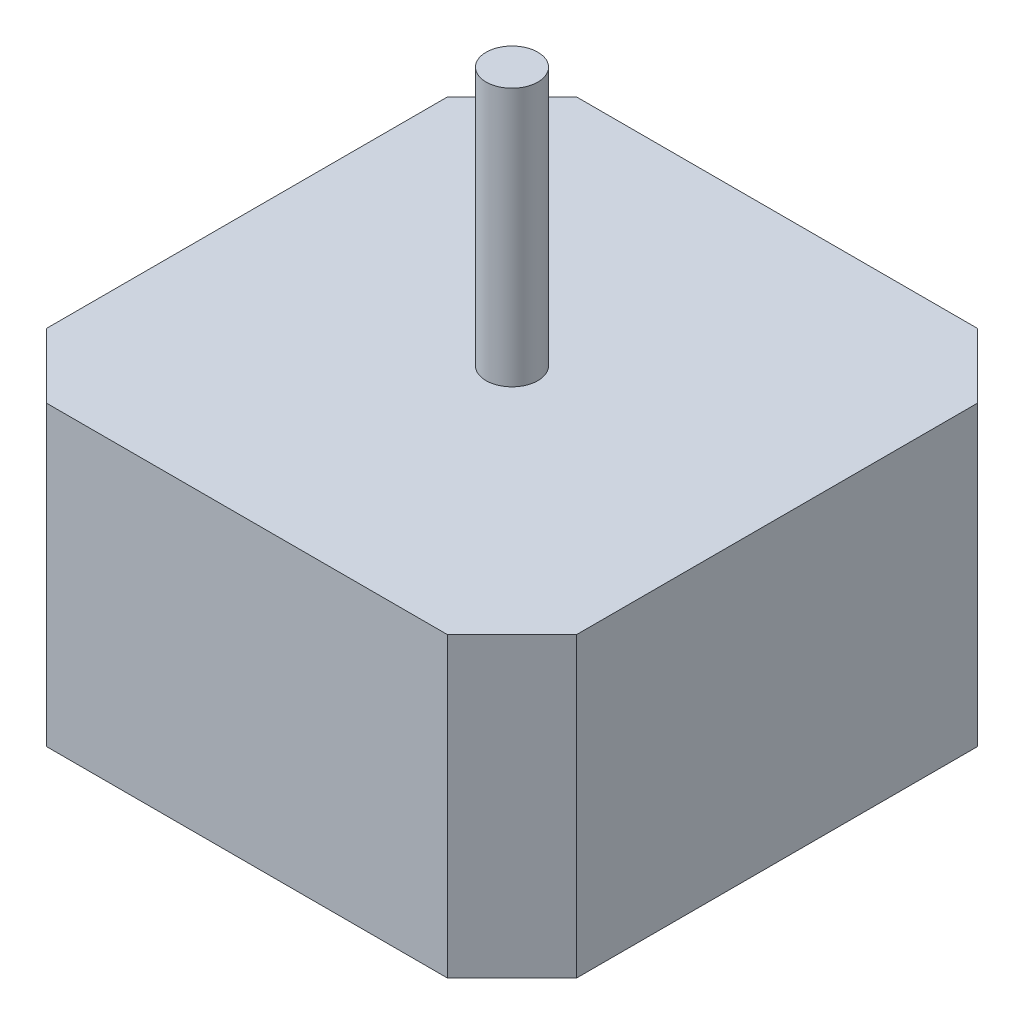
ISO-10303-21;
HEADER;
FILE_DESCRIPTION(('STEP AP214'),'2;1');
FILE_NAME('part.step','',(''),(''),'','','');
FILE_SCHEMA(('AUTOMOTIVE_DESIGN { 1 0 10303 214 1 1 1 1 }'));
ENDSEC;
DATA;
#1=APPLICATION_CONTEXT('core data for automotive mechanical design processes');
#2=APPLICATION_PROTOCOL_DEFINITION('international standard','automotive_design',2000,#1);
#3=PRODUCT_CONTEXT('',#1,'mechanical');
#4=PRODUCT('Part','Part','',(#3));
#5=PRODUCT_RELATED_PRODUCT_CATEGORY('part','',(#4));
#6=PRODUCT_DEFINITION_FORMATION('','',#4);
#7=PRODUCT_DEFINITION_CONTEXT('part definition',#1,'design');
#8=PRODUCT_DEFINITION('design','',#6,#7);
#9=PRODUCT_DEFINITION_SHAPE('','',#8);
#10=(LENGTH_UNIT() NAMED_UNIT(*) SI_UNIT(.MILLI.,.METRE.));
#11=(NAMED_UNIT(*) PLANE_ANGLE_UNIT() SI_UNIT($,.RADIAN.));
#12=(NAMED_UNIT(*) SI_UNIT($,.STERADIAN.) SOLID_ANGLE_UNIT());
#13=UNCERTAINTY_MEASURE_WITH_UNIT(LENGTH_MEASURE(1.E-05),#10,'distance_accuracy_value','');
#14=(GEOMETRIC_REPRESENTATION_CONTEXT(3) GLOBAL_UNCERTAINTY_ASSIGNED_CONTEXT((#13)) GLOBAL_UNIT_ASSIGNED_CONTEXT((#10,
#11,#12)) REPRESENTATION_CONTEXT('',''));
#15=CARTESIAN_POINT('',(0.,0.,0.));
#16=DIRECTION('',(0.,0.,1.));
#17=DIRECTION('',(1.,0.,0.));
#18=AXIS2_PLACEMENT_3D('',#15,#16,#17);
#19=CARTESIAN_POINT('',(7.50925109046818,23.,0.));
#20=DIRECTION('',(-1.,0.,0.));
#21=DIRECTION('',(0.,0.,1.));
#22=AXIS2_PLACEMENT_3D('',#19,#20,#21);
#23=PLANE('',#22);
#24=DIRECTION('',(0.,0.,-1.));
#25=VECTOR('',#24,1.);
#26=CARTESIAN_POINT('',(7.50925109046818,9.,-20.5));
#27=LINE('',#26,#25);
#28=CARTESIAN_POINT('',(7.50925109046818,9.,-20.5));
#29=VERTEX_POINT('',#28);
#30=CARTESIAN_POINT('',(7.50925109046818,9.,-24.5027591201534));
#31=VERTEX_POINT('',#30);
#32=EDGE_CURVE('E139',#29,#31,#27,.T.);
#33=ORIENTED_EDGE('',*,*,#32,.F.);
#34=DIRECTION('',(0.,-1.,0.));
#35=VECTOR('',#34,1.);
#36=CARTESIAN_POINT('',(7.50925109046818,23.,-20.5));
#37=LINE('',#36,#35);
#38=CARTESIAN_POINT('',(7.50925109046818,0.,-20.5));
#39=VERTEX_POINT('',#38);
#40=EDGE_CURVE('E11',#29,#39,#37,.T.);
#41=ORIENTED_EDGE('',*,*,#40,.T.);
#42=DIRECTION('',(0.,0.,-1.));
#43=VECTOR('',#42,1.);
#44=CARTESIAN_POINT('',(7.50925109046818,0.,0.));
#45=LINE('',#44,#43);
#46=CARTESIAN_POINT('',(7.50925109046818,0.,-24.5027591201534));
#47=VERTEX_POINT('',#46);
#48=EDGE_CURVE('E169',#39,#47,#45,.T.);
#49=ORIENTED_EDGE('',*,*,#48,.T.);
#50=DIRECTION('',(0.,-1.,0.));
#51=VECTOR('',#50,1.);
#52=CARTESIAN_POINT('',(7.50925109046818,23.,-24.5027591201534));
#53=LINE('',#52,#51);
#54=EDGE_CURVE('E51',#31,#47,#53,.T.);
#55=ORIENTED_EDGE('',*,*,#54,.F.);
#56=EDGE_LOOP('',(#33,#41,#49,#55));
#57=FACE_BOUND('',#56,.T.);
#58=ADVANCED_FACE('F43',(#57),#23,.F.);
#59=CARTESIAN_POINT('',(0.,23.,-24.5027591201534));
#60=DIRECTION('',(0.,0.,-1.));
#61=DIRECTION('',(-1.,0.,0.));
#62=AXIS2_PLACEMENT_3D('',#59,#60,#61);
#63=PLANE('',#62);
#64=DIRECTION('',(0.,-1.,0.));
#65=VECTOR('',#64,1.);
#66=CARTESIAN_POINT('',(-7.48468716332695,23.,-24.5027591201534));
#67=LINE('',#66,#65);
#68=CARTESIAN_POINT('',(-7.48468716332695,9.,-24.5027591201534));
#69=VERTEX_POINT('',#68);
#70=CARTESIAN_POINT('',(-7.48468716332695,0.,-24.5027591201534));
#71=VERTEX_POINT('',#70);
#72=EDGE_CURVE('E150',#69,#71,#67,.T.);
#73=ORIENTED_EDGE('',*,*,#72,.F.);
#74=DIRECTION('',(-1.,0.,0.));
#75=VECTOR('',#74,1.);
#76=CARTESIAN_POINT('',(7.50925109046818,9.,-24.5027591201534));
#77=LINE('',#76,#75);
#78=EDGE_CURVE('E58',#31,#69,#77,.T.);
#79=ORIENTED_EDGE('',*,*,#78,.F.);
#80=ORIENTED_EDGE('',*,*,#54,.T.);
#81=DIRECTION('',(1.,0.,0.));
#82=VECTOR('',#81,1.);
#83=CARTESIAN_POINT('',(0.,0.,-24.5027591201534));
#84=LINE('',#83,#82);
#85=EDGE_CURVE('E166',#71,#47,#84,.T.);
#86=ORIENTED_EDGE('',*,*,#85,.F.);
#87=EDGE_LOOP('',(#73,#79,#80,#86));
#88=FACE_BOUND('',#87,.T.);
#89=ADVANCED_FACE('F164',(#88),#63,.T.);
#90=CARTESIAN_POINT('',(-7.48468716332695,23.,0.));
#91=DIRECTION('',(-1.,0.,0.));
#92=DIRECTION('',(0.,0.,1.));
#93=AXIS2_PLACEMENT_3D('',#90,#91,#92);
#94=PLANE('',#93);
#95=DIRECTION('',(0.,-1.,0.));
#96=VECTOR('',#95,1.);
#97=CARTESIAN_POINT('',(-7.48468716332695,23.,-20.5));
#98=LINE('',#97,#96);
#99=CARTESIAN_POINT('',(-7.48468716332695,9.,-20.5));
#100=VERTEX_POINT('',#99);
#101=CARTESIAN_POINT('',(-7.48468716332695,0.,-20.5));
#102=VERTEX_POINT('',#101);
#103=EDGE_CURVE('E135',#100,#102,#98,.T.);
#104=ORIENTED_EDGE('',*,*,#103,.F.);
#105=DIRECTION('',(0.,0.,1.));
#106=VECTOR('',#105,1.);
#107=CARTESIAN_POINT('',(-7.48468716332695,9.,-24.5027591201534));
#108=LINE('',#107,#106);
#109=EDGE_CURVE('E140',#69,#100,#108,.T.);
#110=ORIENTED_EDGE('',*,*,#109,.F.);
#111=ORIENTED_EDGE('',*,*,#72,.T.);
#112=DIRECTION('',(0.,0.,-1.));
#113=VECTOR('',#112,1.);
#114=CARTESIAN_POINT('',(-7.48468716332695,0.,0.));
#115=LINE('',#114,#113);
#116=EDGE_CURVE('E149',#102,#71,#115,.T.);
#117=ORIENTED_EDGE('',*,*,#116,.F.);
#118=EDGE_LOOP('',(#104,#110,#111,#117));
#119=FACE_BOUND('',#118,.T.);
#120=ADVANCED_FACE('F147',(#119),#94,.T.);
#121=CARTESIAN_POINT('',(0.,23.,0.));
#122=DIRECTION('',(0.,1.,0.));
#123=DIRECTION('',(0.,0.,1.));
#124=AXIS2_PLACEMENT_3D('',#121,#122,#123);
#125=PLANE('',#124);
#126=CARTESIAN_POINT('',(0.,23.,0.));
#127=DIRECTION('',(0.,1.,0.));
#128=DIRECTION('',(0.,0.,1.));
#129=AXIS2_PLACEMENT_3D('',#126,#127,#128);
#130=CIRCLE('',#129,2.);
#131=CARTESIAN_POINT('',(0.,23.,2.));
#132=VERTEX_POINT('',#131);
#133=EDGE_CURVE('E240',#132,#132,#130,.T.);
#134=ORIENTED_EDGE('',*,*,#133,.F.);
#135=EDGE_LOOP('',(#134));
#136=FACE_BOUND('',#135,.T.);
#137=DIRECTION('',(1.,0.,0.));
#138=VECTOR('',#137,1.);
#139=CARTESIAN_POINT('',(0.,23.,-20.5));
#140=LINE('',#139,#138);
#141=CARTESIAN_POINT('',(-15.5,23.,-20.5));
#142=VERTEX_POINT('',#141);
#143=CARTESIAN_POINT('',(15.5,23.,-20.5));
#144=VERTEX_POINT('',#143);
#145=EDGE_CURVE('E200',#142,#144,#140,.T.);
#146=ORIENTED_EDGE('',*,*,#145,.F.);
#147=DIRECTION('',(0.707106781186548,0.,-0.707106781186548));
#148=VECTOR('',#147,1.);
#149=CARTESIAN_POINT('',(-20.5,23.,-15.5));
#150=LINE('',#149,#148);
#151=CARTESIAN_POINT('',(-20.5,23.,-15.5));
#152=VERTEX_POINT('',#151);
#153=EDGE_CURVE('E206',#152,#142,#150,.T.);
#154=ORIENTED_EDGE('',*,*,#153,.F.);
#155=DIRECTION('',(0.,0.,1.));
#156=VECTOR('',#155,1.);
#157=CARTESIAN_POINT('',(-20.5,23.,0.));
#158=LINE('',#157,#156);
#159=CARTESIAN_POINT('',(-20.5,23.,15.5));
#160=VERTEX_POINT('',#159);
#161=EDGE_CURVE('E155',#152,#160,#158,.T.);
#162=ORIENTED_EDGE('',*,*,#161,.T.);
#163=DIRECTION('',(0.707106781186548,0.,0.707106781186548));
#164=VECTOR('',#163,1.);
#165=CARTESIAN_POINT('',(-20.5,23.,15.5));
#166=LINE('',#165,#164);
#167=CARTESIAN_POINT('',(-15.5,23.,20.5));
#168=VERTEX_POINT('',#167);
#169=EDGE_CURVE('E231',#160,#168,#166,.T.);
#170=ORIENTED_EDGE('',*,*,#169,.T.);
#171=DIRECTION('',(1.,0.,0.));
#172=VECTOR('',#171,1.);
#173=CARTESIAN_POINT('',(0.,23.,20.5));
#174=LINE('',#173,#172);
#175=CARTESIAN_POINT('',(15.5,23.,20.5));
#176=VERTEX_POINT('',#175);
#177=EDGE_CURVE('E151',#168,#176,#174,.T.);
#178=ORIENTED_EDGE('',*,*,#177,.T.);
#179=DIRECTION('',(-0.707106781186547,0.,0.707106781186548));
#180=VECTOR('',#179,1.);
#181=CARTESIAN_POINT('',(20.5,23.,15.5));
#182=LINE('',#181,#180);
#183=CARTESIAN_POINT('',(20.5,23.,15.5));
#184=VERTEX_POINT('',#183);
#185=EDGE_CURVE('E220',#184,#176,#182,.T.);
#186=ORIENTED_EDGE('',*,*,#185,.F.);
#187=DIRECTION('',(0.,0.,1.));
#188=VECTOR('',#187,1.);
#189=CARTESIAN_POINT('',(20.5,23.,0.));
#190=LINE('',#189,#188);
#191=CARTESIAN_POINT('',(20.5,23.,-15.5));
#192=VERTEX_POINT('',#191);
#193=EDGE_CURVE('E187',#192,#184,#190,.T.);
#194=ORIENTED_EDGE('',*,*,#193,.F.);
#195=DIRECTION('',(0.707106781186548,0.,0.707106781186548));
#196=VECTOR('',#195,1.);
#197=CARTESIAN_POINT('',(15.5,23.,-20.5));
#198=LINE('',#197,#196);
#199=EDGE_CURVE('E212',#144,#192,#198,.T.);
#200=ORIENTED_EDGE('',*,*,#199,.F.);
#201=EDGE_LOOP('',(#146,#154,#162,#170,#178,#186,#194,#200));
#202=FACE_BOUND('',#201,.T.);
#203=ADVANCED_FACE('F254',(#136,#202),#125,.T.);
#204=CARTESIAN_POINT('',(0.,0.,0.));
#205=DIRECTION('',(0.,1.,0.));
#206=DIRECTION('',(0.,0.,1.));
#207=AXIS2_PLACEMENT_3D('',#204,#205,#206);
#208=PLANE('',#207);
#209=DIRECTION('',(1.,0.,0.));
#210=VECTOR('',#209,1.);
#211=CARTESIAN_POINT('',(0.,0.,20.5));
#212=LINE('',#211,#210);
#213=CARTESIAN_POINT('',(-15.5,0.,20.5));
#214=VERTEX_POINT('',#213);
#215=CARTESIAN_POINT('',(15.5,0.,20.5));
#216=VERTEX_POINT('',#215);
#217=EDGE_CURVE('E158',#214,#216,#212,.T.);
#218=ORIENTED_EDGE('',*,*,#217,.F.);
#219=DIRECTION('',(0.707106781186548,0.,0.707106781186548));
#220=VECTOR('',#219,1.);
#221=CARTESIAN_POINT('',(-20.5,0.,15.5));
#222=LINE('',#221,#220);
#223=CARTESIAN_POINT('',(-20.5,0.,15.5));
#224=VERTEX_POINT('',#223);
#225=EDGE_CURVE('E225',#224,#214,#222,.T.);
#226=ORIENTED_EDGE('',*,*,#225,.F.);
#227=DIRECTION('',(0.,0.,1.));
#228=VECTOR('',#227,1.);
#229=CARTESIAN_POINT('',(-20.5,0.,0.));
#230=LINE('',#229,#228);
#231=CARTESIAN_POINT('',(-20.5,0.,-15.5));
#232=VERTEX_POINT('',#231);
#233=EDGE_CURVE('E180',#232,#224,#230,.T.);
#234=ORIENTED_EDGE('',*,*,#233,.F.);
#235=DIRECTION('',(0.707106781186548,0.,-0.707106781186548));
#236=VECTOR('',#235,1.);
#237=CARTESIAN_POINT('',(-20.5,0.,-15.5));
#238=LINE('',#237,#236);
#239=CARTESIAN_POINT('',(-15.5,0.,-20.5));
#240=VERTEX_POINT('',#239);
#241=EDGE_CURVE('E207',#232,#240,#238,.T.);
#242=ORIENTED_EDGE('',*,*,#241,.T.);
#243=DIRECTION('',(1.,0.,0.));
#244=VECTOR('',#243,1.);
#245=CARTESIAN_POINT('',(0.,0.,-20.5));
#246=LINE('',#245,#244);
#247=EDGE_CURVE('E177',#240,#102,#246,.T.);
#248=ORIENTED_EDGE('',*,*,#247,.T.);
#249=ORIENTED_EDGE('',*,*,#116,.T.);
#250=ORIENTED_EDGE('',*,*,#85,.T.);
#251=ORIENTED_EDGE('',*,*,#48,.F.);
#252=CARTESIAN_POINT('',(15.5,0.,-20.5));
#253=VERTEX_POINT('',#252);
#254=EDGE_CURVE('E172',#39,#253,#246,.T.);
#255=ORIENTED_EDGE('',*,*,#254,.T.);
#256=DIRECTION('',(0.707106781186548,0.,0.707106781186548));
#257=VECTOR('',#256,1.);
#258=CARTESIAN_POINT('',(15.5,0.,-20.5));
#259=LINE('',#258,#257);
#260=CARTESIAN_POINT('',(20.5,0.,-15.5));
#261=VERTEX_POINT('',#260);
#262=EDGE_CURVE('E66',#253,#261,#259,.T.);
#263=ORIENTED_EDGE('',*,*,#262,.T.);
#264=DIRECTION('',(0.,0.,1.));
#265=VECTOR('',#264,1.);
#266=CARTESIAN_POINT('',(20.5,0.,0.));
#267=LINE('',#266,#265);
#268=CARTESIAN_POINT('',(20.5,0.,15.5));
#269=VERTEX_POINT('',#268);
#270=EDGE_CURVE('E190',#261,#269,#267,.T.);
#271=ORIENTED_EDGE('',*,*,#270,.T.);
#272=DIRECTION('',(-0.707106781186547,0.,0.707106781186548));
#273=VECTOR('',#272,1.);
#274=CARTESIAN_POINT('',(20.5,0.,15.5));
#275=LINE('',#274,#273);
#276=EDGE_CURVE('E222',#269,#216,#275,.T.);
#277=ORIENTED_EDGE('',*,*,#276,.T.);
#278=EDGE_LOOP('',(#218,#226,#234,#242,#248,#249,#250,#251,#255,#263,#271,#277));
#279=FACE_BOUND('',#278,.T.);
#280=ADVANCED_FACE('F175',(#279),#208,.F.);
#281=CARTESIAN_POINT('',(20.5,23.,0.));
#282=DIRECTION('',(1.,0.,0.));
#283=DIRECTION('',(0.,0.,-1.));
#284=AXIS2_PLACEMENT_3D('',#281,#282,#283);
#285=PLANE('',#284);
#286=ORIENTED_EDGE('',*,*,#193,.T.);
#287=DIRECTION('',(0.,-1.,0.));
#288=VECTOR('',#287,1.);
#289=CARTESIAN_POINT('',(20.5,23.,15.5));
#290=LINE('',#289,#288);
#291=EDGE_CURVE('E216',#184,#269,#290,.T.);
#292=ORIENTED_EDGE('',*,*,#291,.T.);
#293=ORIENTED_EDGE('',*,*,#270,.F.);
#294=DIRECTION('',(0.,-1.,0.));
#295=VECTOR('',#294,1.);
#296=CARTESIAN_POINT('',(20.5,23.,-15.5));
#297=LINE('',#296,#295);
#298=EDGE_CURVE('E214',#192,#261,#297,.T.);
#299=ORIENTED_EDGE('',*,*,#298,.F.);
#300=EDGE_LOOP('',(#286,#292,#293,#299));
#301=FACE_BOUND('',#300,.T.);
#302=ADVANCED_FACE('F45',(#301),#285,.T.);
#303=CARTESIAN_POINT('',(0.,23.,20.5));
#304=DIRECTION('',(0.,0.,-1.));
#305=DIRECTION('',(-1.,0.,0.));
#306=AXIS2_PLACEMENT_3D('',#303,#304,#305);
#307=PLANE('',#306);
#308=ORIENTED_EDGE('',*,*,#177,.F.);
#309=DIRECTION('',(0.,-1.,0.));
#310=VECTOR('',#309,1.);
#311=CARTESIAN_POINT('',(-15.5,23.,20.5));
#312=LINE('',#311,#310);
#313=EDGE_CURVE('E209',#168,#214,#312,.T.);
#314=ORIENTED_EDGE('',*,*,#313,.T.);
#315=ORIENTED_EDGE('',*,*,#217,.T.);
#316=DIRECTION('',(0.,-1.,0.));
#317=VECTOR('',#316,1.);
#318=CARTESIAN_POINT('',(15.5,23.,20.5));
#319=LINE('',#318,#317);
#320=EDGE_CURVE('E223',#176,#216,#319,.T.);
#321=ORIENTED_EDGE('',*,*,#320,.F.);
#322=EDGE_LOOP('',(#308,#314,#315,#321));
#323=FACE_BOUND('',#322,.T.);
#324=ADVANCED_FACE('F271',(#323),#307,.F.);
#325=CARTESIAN_POINT('',(0.,23.,-20.5));
#326=DIRECTION('',(0.,0.,-1.));
#327=DIRECTION('',(-1.,0.,0.));
#328=AXIS2_PLACEMENT_3D('',#325,#326,#327);
#329=PLANE('',#328);
#330=ORIENTED_EDGE('',*,*,#247,.F.);
#331=DIRECTION('',(0.,-1.,0.));
#332=VECTOR('',#331,1.);
#333=CARTESIAN_POINT('',(-15.5,23.,-20.5));
#334=LINE('',#333,#332);
#335=EDGE_CURVE('E195',#142,#240,#334,.T.);
#336=ORIENTED_EDGE('',*,*,#335,.F.);
#337=ORIENTED_EDGE('',*,*,#145,.T.);
#338=DIRECTION('',(0.,-1.,0.));
#339=VECTOR('',#338,1.);
#340=CARTESIAN_POINT('',(15.5,23.,-20.5));
#341=LINE('',#340,#339);
#342=EDGE_CURVE('E218',#144,#253,#341,.T.);
#343=ORIENTED_EDGE('',*,*,#342,.T.);
#344=ORIENTED_EDGE('',*,*,#254,.F.);
#345=ORIENTED_EDGE('',*,*,#40,.F.);
#346=DIRECTION('',(1.,0.,0.));
#347=VECTOR('',#346,1.);
#348=CARTESIAN_POINT('',(-7.48468716332695,9.,-20.5));
#349=LINE('',#348,#347);
#350=EDGE_CURVE('E131',#100,#29,#349,.T.);
#351=ORIENTED_EDGE('',*,*,#350,.F.);
#352=ORIENTED_EDGE('',*,*,#103,.T.);
#353=EDGE_LOOP('',(#330,#336,#337,#343,#344,#345,#351,#352));
#354=FACE_BOUND('',#353,.T.);
#355=ADVANCED_FACE('F133',(#354),#329,.T.);
#356=CARTESIAN_POINT('',(-20.5,23.,0.));
#357=DIRECTION('',(1.,0.,0.));
#358=DIRECTION('',(0.,0.,-1.));
#359=AXIS2_PLACEMENT_3D('',#356,#357,#358);
#360=PLANE('',#359);
#361=ORIENTED_EDGE('',*,*,#233,.T.);
#362=DIRECTION('',(0.,-1.,0.));
#363=VECTOR('',#362,1.);
#364=CARTESIAN_POINT('',(-20.5,23.,15.5));
#365=LINE('',#364,#363);
#366=EDGE_CURVE('E229',#160,#224,#365,.T.);
#367=ORIENTED_EDGE('',*,*,#366,.F.);
#368=ORIENTED_EDGE('',*,*,#161,.F.);
#369=DIRECTION('',(0.,-1.,0.));
#370=VECTOR('',#369,1.);
#371=CARTESIAN_POINT('',(-20.5,23.,-15.5));
#372=LINE('',#371,#370);
#373=EDGE_CURVE('E192',#152,#232,#372,.T.);
#374=ORIENTED_EDGE('',*,*,#373,.T.);
#375=EDGE_LOOP('',(#361,#367,#368,#374));
#376=FACE_BOUND('',#375,.T.);
#377=ADVANCED_FACE('F265',(#376),#360,.F.);
#378=CARTESIAN_POINT('',(-20.5,23.,-15.5));
#379=DIRECTION('',(-0.707106781186547,0.,-0.707106781186547));
#380=DIRECTION('',(-0.707106781186548,0.,0.707106781186548));
#381=AXIS2_PLACEMENT_3D('',#378,#379,#380);
#382=PLANE('',#381);
#383=ORIENTED_EDGE('',*,*,#241,.F.);
#384=ORIENTED_EDGE('',*,*,#373,.F.);
#385=ORIENTED_EDGE('',*,*,#153,.T.);
#386=ORIENTED_EDGE('',*,*,#335,.T.);
#387=EDGE_LOOP('',(#383,#384,#385,#386));
#388=FACE_BOUND('',#387,.T.);
#389=ADVANCED_FACE('F264',(#388),#382,.T.);
#390=CARTESIAN_POINT('',(20.5,23.,15.5));
#391=DIRECTION('',(0.707106781186548,0.,0.707106781186547));
#392=DIRECTION('',(0.707106781186547,0.,-0.707106781186548));
#393=AXIS2_PLACEMENT_3D('',#390,#391,#392);
#394=PLANE('',#393);
#395=ORIENTED_EDGE('',*,*,#276,.F.);
#396=ORIENTED_EDGE('',*,*,#291,.F.);
#397=ORIENTED_EDGE('',*,*,#185,.T.);
#398=ORIENTED_EDGE('',*,*,#320,.T.);
#399=EDGE_LOOP('',(#395,#396,#397,#398));
#400=FACE_BOUND('',#399,.T.);
#401=ADVANCED_FACE('F286',(#400),#394,.T.);
#402=CARTESIAN_POINT('',(-20.5,23.,15.5));
#403=DIRECTION('',(0.707106781186547,0.,-0.707106781186547));
#404=DIRECTION('',(-0.707106781186548,0.,-0.707106781186548));
#405=AXIS2_PLACEMENT_3D('',#402,#403,#404);
#406=PLANE('',#405);
#407=ORIENTED_EDGE('',*,*,#225,.T.);
#408=ORIENTED_EDGE('',*,*,#313,.F.);
#409=ORIENTED_EDGE('',*,*,#169,.F.);
#410=ORIENTED_EDGE('',*,*,#366,.T.);
#411=EDGE_LOOP('',(#407,#408,#409,#410));
#412=FACE_BOUND('',#411,.T.);
#413=ADVANCED_FACE('F268',(#412),#406,.F.);
#414=CARTESIAN_POINT('',(15.5,23.,-20.5));
#415=DIRECTION('',(0.707106781186547,0.,-0.707106781186547));
#416=DIRECTION('',(-0.707106781186548,0.,-0.707106781186548));
#417=AXIS2_PLACEMENT_3D('',#414,#415,#416);
#418=PLANE('',#417);
#419=ORIENTED_EDGE('',*,*,#262,.F.);
#420=ORIENTED_EDGE('',*,*,#342,.F.);
#421=ORIENTED_EDGE('',*,*,#199,.T.);
#422=ORIENTED_EDGE('',*,*,#298,.T.);
#423=EDGE_LOOP('',(#419,#420,#421,#422));
#424=FACE_BOUND('',#423,.T.);
#425=ADVANCED_FACE('F277',(#424),#418,.T.);
#426=CARTESIAN_POINT('',(0.,9.,0.));
#427=DIRECTION('',(0.,1.,0.));
#428=DIRECTION('',(0.,0.,1.));
#429=AXIS2_PLACEMENT_3D('',#426,#427,#428);
#430=PLANE('',#429);
#431=ORIENTED_EDGE('',*,*,#78,.T.);
#432=ORIENTED_EDGE('',*,*,#109,.T.);
#433=ORIENTED_EDGE('',*,*,#350,.T.);
#434=ORIENTED_EDGE('',*,*,#32,.T.);
#435=EDGE_LOOP('',(#431,#432,#433,#434));
#436=FACE_BOUND('',#435,.T.);
#437=ADVANCED_FACE('F142',(#436),#430,.T.);
#438=CARTESIAN_POINT('',(0.,43.,0.));
#439=DIRECTION('',(0.,-1.,0.));
#440=DIRECTION('',(0.,0.,-1.));
#441=AXIS2_PLACEMENT_3D('',#438,#439,#440);
#442=CYLINDRICAL_SURFACE('',#441,2.);
#443=CARTESIAN_POINT('',(0.,43.,0.));
#444=DIRECTION('',(0.,1.,0.));
#445=DIRECTION('',(0.,0.,1.));
#446=AXIS2_PLACEMENT_3D('',#443,#444,#445);
#447=CIRCLE('',#446,2.);
#448=CARTESIAN_POINT('',(0.,43.,2.));
#449=VERTEX_POINT('',#448);
#450=EDGE_CURVE('E239',#449,#449,#447,.T.);
#451=ORIENTED_EDGE('',*,*,#450,.F.);
#452=EDGE_LOOP('',(#451));
#453=FACE_BOUND('',#452,.T.);
#454=ORIENTED_EDGE('',*,*,#133,.T.);
#455=EDGE_LOOP('',(#454));
#456=FACE_BOUND('',#455,.T.);
#457=ADVANCED_FACE('F248',(#453,#456),#442,.T.);
#458=CARTESIAN_POINT('',(0.,43.,0.));
#459=DIRECTION('',(0.,1.,0.));
#460=DIRECTION('',(0.,0.,1.));
#461=AXIS2_PLACEMENT_3D('',#458,#459,#460);
#462=PLANE('',#461);
#463=ORIENTED_EDGE('',*,*,#450,.T.);
#464=EDGE_LOOP('',(#463));
#465=FACE_BOUND('',#464,.T.);
#466=ADVANCED_FACE('F246',(#465),#462,.T.);
#467=CLOSED_SHELL('',(#58,#89,#120,#203,#280,#302,#324,#355,#377,#389,#401,#413,#425,#437,#457,#466));
#468=MANIFOLD_SOLID_BREP('B2',#467);
#469=ADVANCED_BREP_SHAPE_REPRESENTATION('',(#18,#468),#14);
#470=SHAPE_DEFINITION_REPRESENTATION(#9,#469);
ENDSEC;
END-ISO-10303-21;
